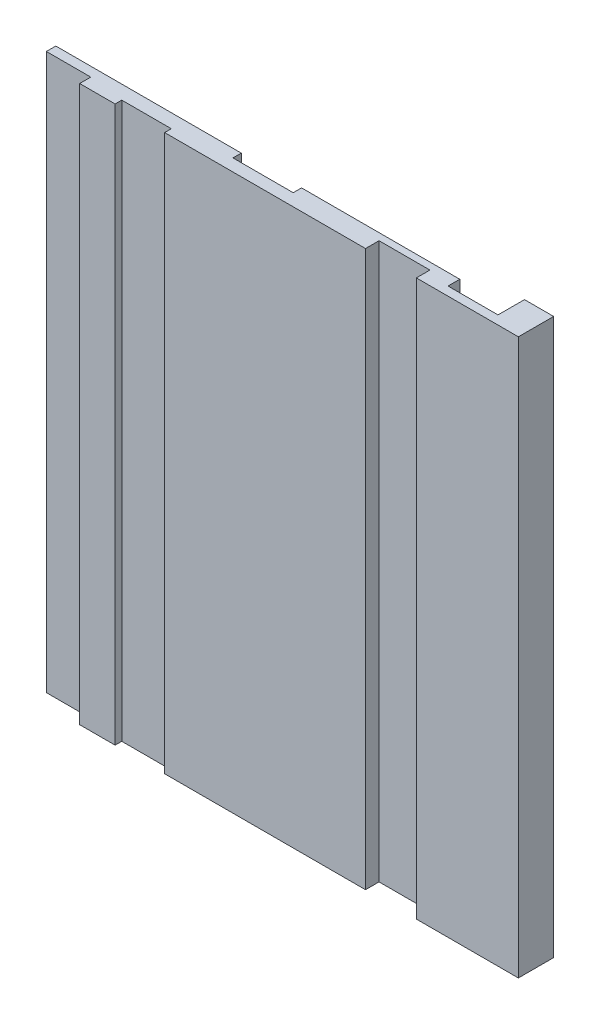
ISO-10303-21;
HEADER;
FILE_DESCRIPTION(('STEP AP214'),'2;1');
FILE_NAME('part.step','',(''),(''),'','','');
FILE_SCHEMA(('AUTOMOTIVE_DESIGN { 1 0 10303 214 1 1 1 1 }'));
ENDSEC;
DATA;
#1=APPLICATION_CONTEXT('core data for automotive mechanical design processes');
#2=APPLICATION_PROTOCOL_DEFINITION('international standard','automotive_design',2000,#1);
#3=PRODUCT_CONTEXT('',#1,'mechanical');
#4=PRODUCT('Part','Part','',(#3));
#5=PRODUCT_RELATED_PRODUCT_CATEGORY('part','',(#4));
#6=PRODUCT_DEFINITION_FORMATION('','',#4);
#7=PRODUCT_DEFINITION_CONTEXT('part definition',#1,'design');
#8=PRODUCT_DEFINITION('design','',#6,#7);
#9=PRODUCT_DEFINITION_SHAPE('','',#8);
#10=(LENGTH_UNIT() NAMED_UNIT(*) SI_UNIT(.MILLI.,.METRE.));
#11=(NAMED_UNIT(*) PLANE_ANGLE_UNIT() SI_UNIT($,.RADIAN.));
#12=(NAMED_UNIT(*) SI_UNIT($,.STERADIAN.) SOLID_ANGLE_UNIT());
#13=UNCERTAINTY_MEASURE_WITH_UNIT(LENGTH_MEASURE(1.E-05),#10,'distance_accuracy_value','');
#14=(GEOMETRIC_REPRESENTATION_CONTEXT(3) GLOBAL_UNCERTAINTY_ASSIGNED_CONTEXT((#13)) GLOBAL_UNIT_ASSIGNED_CONTEXT((#10,
#11,#12)) REPRESENTATION_CONTEXT('',''));
#15=CARTESIAN_POINT('',(0.,0.,0.));
#16=DIRECTION('',(0.,0.,1.));
#17=DIRECTION('',(1.,0.,0.));
#18=AXIS2_PLACEMENT_3D('',#15,#16,#17);
#19=CARTESIAN_POINT('',(0.,100.,0.));
#20=DIRECTION('',(-1.,0.,0.));
#21=DIRECTION('',(0.,0.,1.));
#22=AXIS2_PLACEMENT_3D('',#19,#20,#21);
#23=PLANE('',#22);
#24=DIRECTION('',(0.,0.,-1.));
#25=VECTOR('',#24,1.);
#26=CARTESIAN_POINT('',(0.,0.,0.));
#27=LINE('',#26,#25);
#28=CARTESIAN_POINT('',(0.,0.,0.));
#29=VERTEX_POINT('',#28);
#30=CARTESIAN_POINT('',(0.,0.,-6.35));
#31=VERTEX_POINT('',#30);
#32=EDGE_CURVE('E217',#29,#31,#27,.T.);
#33=ORIENTED_EDGE('',*,*,#32,.T.);
#34=DIRECTION('',(0.,-1.,0.));
#35=VECTOR('',#34,1.);
#36=CARTESIAN_POINT('',(0.,100.,-6.35));
#37=LINE('',#36,#35);
#38=CARTESIAN_POINT('',(0.,100.,-6.35));
#39=VERTEX_POINT('',#38);
#40=EDGE_CURVE('E11',#39,#31,#37,.T.);
#41=ORIENTED_EDGE('',*,*,#40,.F.);
#42=DIRECTION('',(0.,0.,-1.));
#43=VECTOR('',#42,1.);
#44=CARTESIAN_POINT('',(0.,100.,0.));
#45=LINE('',#44,#43);
#46=CARTESIAN_POINT('',(0.,100.,0.));
#47=VERTEX_POINT('',#46);
#48=EDGE_CURVE('E260',#47,#39,#45,.T.);
#49=ORIENTED_EDGE('',*,*,#48,.F.);
#50=DIRECTION('',(0.,-1.,0.));
#51=VECTOR('',#50,1.);
#52=CARTESIAN_POINT('',(0.,100.,0.));
#53=LINE('',#52,#51);
#54=EDGE_CURVE('E213',#47,#29,#53,.T.);
#55=ORIENTED_EDGE('',*,*,#54,.T.);
#56=EDGE_LOOP('',(#33,#41,#49,#55));
#57=FACE_BOUND('',#56,.T.);
#58=ADVANCED_FACE('F37',(#57),#23,.F.);
#59=CARTESIAN_POINT('',(0.,100.,-6.35));
#60=DIRECTION('',(0.,0.,1.));
#61=DIRECTION('',(1.,0.,0.));
#62=AXIS2_PLACEMENT_3D('',#59,#60,#61);
#63=PLANE('',#62);
#64=DIRECTION('',(-1.,0.,0.));
#65=VECTOR('',#64,1.);
#66=CARTESIAN_POINT('',(0.,0.,-6.35));
#67=LINE('',#66,#65);
#68=CARTESIAN_POINT('',(-5.25,0.,-6.35));
#69=VERTEX_POINT('',#68);
#70=EDGE_CURVE('E220',#31,#69,#67,.T.);
#71=ORIENTED_EDGE('',*,*,#70,.T.);
#72=DIRECTION('',(0.,-1.,0.));
#73=VECTOR('',#72,1.);
#74=CARTESIAN_POINT('',(-5.25,100.,-6.35));
#75=LINE('',#74,#73);
#76=CARTESIAN_POINT('',(-5.25,100.,-6.35));
#77=VERTEX_POINT('',#76);
#78=EDGE_CURVE('E45',#77,#69,#75,.T.);
#79=ORIENTED_EDGE('',*,*,#78,.F.);
#80=DIRECTION('',(-1.,0.,0.));
#81=VECTOR('',#80,1.);
#82=CARTESIAN_POINT('',(0.,100.,-6.35));
#83=LINE('',#82,#81);
#84=EDGE_CURVE('E138',#39,#77,#83,.T.);
#85=ORIENTED_EDGE('',*,*,#84,.F.);
#86=ORIENTED_EDGE('',*,*,#40,.T.);
#87=EDGE_LOOP('',(#71,#79,#85,#86));
#88=FACE_BOUND('',#87,.T.);
#89=ADVANCED_FACE('F317',(#88),#63,.F.);
#90=CARTESIAN_POINT('',(-5.25,100.,-1.58));
#91=DIRECTION('',(1.,0.,0.));
#92=DIRECTION('',(0.,0.,-1.));
#93=AXIS2_PLACEMENT_3D('',#90,#91,#92);
#94=PLANE('',#93);
#95=DIRECTION('',(0.,0.,1.));
#96=VECTOR('',#95,1.);
#97=CARTESIAN_POINT('',(-5.25,0.,-1.58));
#98=LINE('',#97,#96);
#99=CARTESIAN_POINT('',(-5.25,0.,-1.58));
#100=VERTEX_POINT('',#99);
#101=EDGE_CURVE('E223',#69,#100,#98,.T.);
#102=ORIENTED_EDGE('',*,*,#101,.T.);
#103=DIRECTION('',(0.,-1.,0.));
#104=VECTOR('',#103,1.);
#105=CARTESIAN_POINT('',(-5.25,100.,-1.58));
#106=LINE('',#105,#104);
#107=CARTESIAN_POINT('',(-5.25,100.,-1.58));
#108=VERTEX_POINT('',#107);
#109=EDGE_CURVE('E309',#108,#100,#106,.T.);
#110=ORIENTED_EDGE('',*,*,#109,.F.);
#111=DIRECTION('',(0.,0.,1.));
#112=VECTOR('',#111,1.);
#113=CARTESIAN_POINT('',(-5.25,100.,-3.69999999999999));
#114=LINE('',#113,#112);
#115=EDGE_CURVE('E316',#77,#108,#114,.T.);
#116=ORIENTED_EDGE('',*,*,#115,.F.);
#117=ORIENTED_EDGE('',*,*,#78,.T.);
#118=EDGE_LOOP('',(#102,#110,#116,#117));
#119=FACE_BOUND('',#118,.T.);
#120=ADVANCED_FACE('F314',(#119),#94,.F.);
#121=CARTESIAN_POINT('',(-14.25,100.,-1.58));
#122=DIRECTION('',(0.,0.,1.));
#123=DIRECTION('',(1.,0.,0.));
#124=AXIS2_PLACEMENT_3D('',#121,#122,#123);
#125=PLANE('',#124);
#126=DIRECTION('',(-1.,0.,0.));
#127=VECTOR('',#126,1.);
#128=CARTESIAN_POINT('',(-14.25,0.,-1.58));
#129=LINE('',#128,#127);
#130=CARTESIAN_POINT('',(-14.25,0.,-1.58));
#131=VERTEX_POINT('',#130);
#132=EDGE_CURVE('E225',#100,#131,#129,.T.);
#133=ORIENTED_EDGE('',*,*,#132,.T.);
#134=DIRECTION('',(0.,-1.,0.));
#135=VECTOR('',#134,1.);
#136=CARTESIAN_POINT('',(-14.25,100.,-1.58));
#137=LINE('',#136,#135);
#138=CARTESIAN_POINT('',(-14.25,100.,-1.58));
#139=VERTEX_POINT('',#138);
#140=EDGE_CURVE('E306',#139,#131,#137,.T.);
#141=ORIENTED_EDGE('',*,*,#140,.F.);
#142=DIRECTION('',(-1.,0.,0.));
#143=VECTOR('',#142,1.);
#144=CARTESIAN_POINT('',(-14.25,100.,-1.58));
#145=LINE('',#144,#143);
#146=EDGE_CURVE('E336',#108,#139,#145,.T.);
#147=ORIENTED_EDGE('',*,*,#146,.F.);
#148=ORIENTED_EDGE('',*,*,#109,.T.);
#149=EDGE_LOOP('',(#133,#141,#147,#148));
#150=FACE_BOUND('',#149,.T.);
#151=ADVANCED_FACE('F327',(#150),#125,.F.);
#152=CARTESIAN_POINT('',(-14.25,100.,-3.69999999999998));
#153=DIRECTION('',(-1.,0.,0.));
#154=DIRECTION('',(0.,0.,1.));
#155=AXIS2_PLACEMENT_3D('',#152,#153,#154);
#156=PLANE('',#155);
#157=DIRECTION('',(0.,0.,-1.));
#158=VECTOR('',#157,1.);
#159=CARTESIAN_POINT('',(-14.25,0.,-3.69999999999998));
#160=LINE('',#159,#158);
#161=CARTESIAN_POINT('',(-14.25,0.,-3.69999999999998));
#162=VERTEX_POINT('',#161);
#163=EDGE_CURVE('E227',#131,#162,#160,.T.);
#164=ORIENTED_EDGE('',*,*,#163,.T.);
#165=DIRECTION('',(0.,-1.,0.));
#166=VECTOR('',#165,1.);
#167=CARTESIAN_POINT('',(-14.25,100.,-3.69999999999998));
#168=LINE('',#167,#166);
#169=CARTESIAN_POINT('',(-14.25,100.,-3.69999999999998));
#170=VERTEX_POINT('',#169);
#171=EDGE_CURVE('E303',#170,#162,#168,.T.);
#172=ORIENTED_EDGE('',*,*,#171,.F.);
#173=DIRECTION('',(0.,0.,-1.));
#174=VECTOR('',#173,1.);
#175=CARTESIAN_POINT('',(-14.25,100.,-3.69999999999998));
#176=LINE('',#175,#174);
#177=EDGE_CURVE('E333',#139,#170,#176,.T.);
#178=ORIENTED_EDGE('',*,*,#177,.F.);
#179=ORIENTED_EDGE('',*,*,#140,.T.);
#180=EDGE_LOOP('',(#164,#172,#178,#179));
#181=FACE_BOUND('',#180,.T.);
#182=ADVANCED_FACE('F331',(#181),#156,.F.);
#183=CARTESIAN_POINT('',(-42.75,100.,-3.69999999999998));
#184=DIRECTION('',(0.,0.,1.));
#185=DIRECTION('',(1.,0.,0.));
#186=AXIS2_PLACEMENT_3D('',#183,#184,#185);
#187=PLANE('',#186);
#188=DIRECTION('',(-1.,0.,0.));
#189=VECTOR('',#188,1.);
#190=CARTESIAN_POINT('',(-42.75,0.,-3.69999999999998));
#191=LINE('',#190,#189);
#192=CARTESIAN_POINT('',(-42.75,0.,-3.69999999999998));
#193=VERTEX_POINT('',#192);
#194=EDGE_CURVE('E229',#162,#193,#191,.T.);
#195=ORIENTED_EDGE('',*,*,#194,.T.);
#196=DIRECTION('',(0.,-1.,0.));
#197=VECTOR('',#196,1.);
#198=CARTESIAN_POINT('',(-42.75,100.,-3.69999999999998));
#199=LINE('',#198,#197);
#200=CARTESIAN_POINT('',(-42.75,100.,-3.69999999999998));
#201=VERTEX_POINT('',#200);
#202=EDGE_CURVE('E300',#201,#193,#199,.T.);
#203=ORIENTED_EDGE('',*,*,#202,.F.);
#204=DIRECTION('',(-1.,0.,0.));
#205=VECTOR('',#204,1.);
#206=CARTESIAN_POINT('',(-42.75,100.,-3.69999999999998));
#207=LINE('',#206,#205);
#208=EDGE_CURVE('E335',#170,#201,#207,.T.);
#209=ORIENTED_EDGE('',*,*,#208,.F.);
#210=ORIENTED_EDGE('',*,*,#171,.T.);
#211=EDGE_LOOP('',(#195,#203,#209,#210));
#212=FACE_BOUND('',#211,.T.);
#213=ADVANCED_FACE('F430',(#212),#187,.F.);
#214=CARTESIAN_POINT('',(-42.75,100.,-3.69999999999998));
#215=DIRECTION('',(1.,0.,0.));
#216=DIRECTION('',(0.,0.,-1.));
#217=AXIS2_PLACEMENT_3D('',#214,#215,#216);
#218=PLANE('',#217);
#219=DIRECTION('',(0.,0.,1.));
#220=VECTOR('',#219,1.);
#221=CARTESIAN_POINT('',(-42.75,0.,-3.69999999999998));
#222=LINE('',#221,#220);
#223=CARTESIAN_POINT('',(-42.75,0.,-2.19999999999998));
#224=VERTEX_POINT('',#223);
#225=EDGE_CURVE('E231',#193,#224,#222,.T.);
#226=ORIENTED_EDGE('',*,*,#225,.T.);
#227=DIRECTION('',(0.,-1.,0.));
#228=VECTOR('',#227,1.);
#229=CARTESIAN_POINT('',(-42.75,100.,-2.19999999999998));
#230=LINE('',#229,#228);
#231=CARTESIAN_POINT('',(-42.75,100.,-2.19999999999998));
#232=VERTEX_POINT('',#231);
#233=EDGE_CURVE('E297',#232,#224,#230,.T.);
#234=ORIENTED_EDGE('',*,*,#233,.F.);
#235=DIRECTION('',(0.,0.,1.));
#236=VECTOR('',#235,1.);
#237=CARTESIAN_POINT('',(-42.75,100.,-3.69999999999998));
#238=LINE('',#237,#236);
#239=EDGE_CURVE('E338',#201,#232,#238,.T.);
#240=ORIENTED_EDGE('',*,*,#239,.F.);
#241=ORIENTED_EDGE('',*,*,#202,.T.);
#242=EDGE_LOOP('',(#226,#234,#240,#241));
#243=FACE_BOUND('',#242,.T.);
#244=ADVANCED_FACE('F427',(#243),#218,.F.);
#245=CARTESIAN_POINT('',(-42.75,100.,-2.19999999999998));
#246=DIRECTION('',(0.,0.,1.));
#247=DIRECTION('',(1.,0.,0.));
#248=AXIS2_PLACEMENT_3D('',#245,#246,#247);
#249=PLANE('',#248);
#250=DIRECTION('',(-1.,0.,0.));
#251=VECTOR('',#250,1.);
#252=CARTESIAN_POINT('',(-42.75,0.,-2.19999999999998));
#253=LINE('',#252,#251);
#254=CARTESIAN_POINT('',(-53.6,0.,-2.19999999999998));
#255=VERTEX_POINT('',#254);
#256=EDGE_CURVE('E233',#224,#255,#253,.T.);
#257=ORIENTED_EDGE('',*,*,#256,.T.);
#258=DIRECTION('',(0.,-1.,0.));
#259=VECTOR('',#258,1.);
#260=CARTESIAN_POINT('',(-53.6,100.,-2.19999999999998));
#261=LINE('',#260,#259);
#262=CARTESIAN_POINT('',(-53.6,100.,-2.19999999999998));
#263=VERTEX_POINT('',#262);
#264=EDGE_CURVE('E294',#263,#255,#261,.T.);
#265=ORIENTED_EDGE('',*,*,#264,.F.);
#266=DIRECTION('',(-1.,0.,0.));
#267=VECTOR('',#266,1.);
#268=CARTESIAN_POINT('',(-42.75,100.,-2.19999999999998));
#269=LINE('',#268,#267);
#270=EDGE_CURVE('E344',#232,#263,#269,.T.);
#271=ORIENTED_EDGE('',*,*,#270,.F.);
#272=ORIENTED_EDGE('',*,*,#233,.T.);
#273=EDGE_LOOP('',(#257,#265,#271,#272));
#274=FACE_BOUND('',#273,.T.);
#275=ADVANCED_FACE('F422',(#274),#249,.F.);
#276=CARTESIAN_POINT('',(-53.6,100.,-2.19999999999998));
#277=DIRECTION('',(-1.,0.,0.));
#278=DIRECTION('',(0.,0.,1.));
#279=AXIS2_PLACEMENT_3D('',#276,#277,#278);
#280=PLANE('',#279);
#281=DIRECTION('',(0.,0.,-1.));
#282=VECTOR('',#281,1.);
#283=CARTESIAN_POINT('',(-53.6,0.,-2.19999999999998));
#284=LINE('',#283,#282);
#285=CARTESIAN_POINT('',(-53.6,0.,-3.69999999999998));
#286=VERTEX_POINT('',#285);
#287=EDGE_CURVE('E235',#255,#286,#284,.T.);
#288=ORIENTED_EDGE('',*,*,#287,.T.);
#289=DIRECTION('',(0.,-1.,0.));
#290=VECTOR('',#289,1.);
#291=CARTESIAN_POINT('',(-53.6,100.,-3.69999999999998));
#292=LINE('',#291,#290);
#293=CARTESIAN_POINT('',(-53.6,100.,-3.69999999999998));
#294=VERTEX_POINT('',#293);
#295=EDGE_CURVE('E291',#294,#286,#292,.T.);
#296=ORIENTED_EDGE('',*,*,#295,.F.);
#297=DIRECTION('',(0.,0.,-1.));
#298=VECTOR('',#297,1.);
#299=CARTESIAN_POINT('',(-53.6,100.,-2.19999999999998));
#300=LINE('',#299,#298);
#301=EDGE_CURVE('E346',#263,#294,#300,.T.);
#302=ORIENTED_EDGE('',*,*,#301,.F.);
#303=ORIENTED_EDGE('',*,*,#264,.T.);
#304=EDGE_LOOP('',(#288,#296,#302,#303));
#305=FACE_BOUND('',#304,.T.);
#306=ADVANCED_FACE('F417',(#305),#280,.F.);
#307=CARTESIAN_POINT('',(-87.,100.,-3.69999999999999));
#308=DIRECTION('',(0.,0.,1.));
#309=DIRECTION('',(1.,0.,0.));
#310=AXIS2_PLACEMENT_3D('',#307,#308,#309);
#311=PLANE('',#310);
#312=DIRECTION('',(-1.,0.,0.));
#313=VECTOR('',#312,1.);
#314=CARTESIAN_POINT('',(-87.,0.,-3.69999999999999));
#315=LINE('',#314,#313);
#316=CARTESIAN_POINT('',(-87.,0.,-3.69999999999999));
#317=VERTEX_POINT('',#316);
#318=EDGE_CURVE('E237',#286,#317,#315,.T.);
#319=ORIENTED_EDGE('',*,*,#318,.T.);
#320=DIRECTION('',(0.,-1.,0.));
#321=VECTOR('',#320,1.);
#322=CARTESIAN_POINT('',(-87.,100.,-3.69999999999999));
#323=LINE('',#322,#321);
#324=CARTESIAN_POINT('',(-87.,100.,-3.69999999999999));
#325=VERTEX_POINT('',#324);
#326=EDGE_CURVE('E288',#325,#317,#323,.T.);
#327=ORIENTED_EDGE('',*,*,#326,.F.);
#328=DIRECTION('',(-1.,0.,0.));
#329=VECTOR('',#328,1.);
#330=CARTESIAN_POINT('',(-87.,100.,-3.69999999999999));
#331=LINE('',#330,#329);
#332=EDGE_CURVE('E348',#294,#325,#331,.T.);
#333=ORIENTED_EDGE('',*,*,#332,.F.);
#334=ORIENTED_EDGE('',*,*,#295,.T.);
#335=EDGE_LOOP('',(#319,#327,#333,#334));
#336=FACE_BOUND('',#335,.T.);
#337=ADVANCED_FACE('F413',(#336),#311,.F.);
#338=CARTESIAN_POINT('',(-87.,100.,-1.99999999999999));
#339=DIRECTION('',(1.,0.,0.));
#340=DIRECTION('',(0.,0.,-1.));
#341=AXIS2_PLACEMENT_3D('',#338,#339,#340);
#342=PLANE('',#341);
#343=DIRECTION('',(0.,0.,1.));
#344=VECTOR('',#343,1.);
#345=CARTESIAN_POINT('',(-87.,0.,-1.99999999999999));
#346=LINE('',#345,#344);
#347=CARTESIAN_POINT('',(-87.,0.,-1.99999999999999));
#348=VERTEX_POINT('',#347);
#349=EDGE_CURVE('E239',#317,#348,#346,.T.);
#350=ORIENTED_EDGE('',*,*,#349,.T.);
#351=DIRECTION('',(0.,-1.,0.));
#352=VECTOR('',#351,1.);
#353=CARTESIAN_POINT('',(-87.,100.,-1.99999999999999));
#354=LINE('',#353,#352);
#355=CARTESIAN_POINT('',(-87.,100.,-1.99999999999999));
#356=VERTEX_POINT('',#355);
#357=EDGE_CURVE('E285',#356,#348,#354,.T.);
#358=ORIENTED_EDGE('',*,*,#357,.F.);
#359=DIRECTION('',(0.,0.,1.));
#360=VECTOR('',#359,1.);
#361=CARTESIAN_POINT('',(-87.,100.,-1.99999999999999));
#362=LINE('',#361,#360);
#363=EDGE_CURVE('E350',#325,#356,#362,.T.);
#364=ORIENTED_EDGE('',*,*,#363,.F.);
#365=ORIENTED_EDGE('',*,*,#326,.T.);
#366=EDGE_LOOP('',(#350,#358,#364,#365));
#367=FACE_BOUND('',#366,.T.);
#368=ADVANCED_FACE('F408',(#367),#342,.F.);
#369=CARTESIAN_POINT('',(-87.,100.,-1.99999999999999));
#370=DIRECTION('',(0.,0.,-1.));
#371=DIRECTION('',(-1.,0.,0.));
#372=AXIS2_PLACEMENT_3D('',#369,#370,#371);
#373=PLANE('',#372);
#374=DIRECTION('',(1.,0.,0.));
#375=VECTOR('',#374,1.);
#376=CARTESIAN_POINT('',(-87.,0.,-1.99999999999999));
#377=LINE('',#376,#375);
#378=CARTESIAN_POINT('',(-79.,0.,-1.99999999999999));
#379=VERTEX_POINT('',#378);
#380=EDGE_CURVE('E241',#348,#379,#377,.T.);
#381=ORIENTED_EDGE('',*,*,#380,.T.);
#382=DIRECTION('',(0.,-1.,0.));
#383=VECTOR('',#382,1.);
#384=CARTESIAN_POINT('',(-79.,100.,-1.99999999999999));
#385=LINE('',#384,#383);
#386=CARTESIAN_POINT('',(-79.,100.,-1.99999999999999));
#387=VERTEX_POINT('',#386);
#388=EDGE_CURVE('E282',#387,#379,#385,.T.);
#389=ORIENTED_EDGE('',*,*,#388,.F.);
#390=DIRECTION('',(1.,0.,0.));
#391=VECTOR('',#390,1.);
#392=CARTESIAN_POINT('',(-87.,100.,-1.99999999999999));
#393=LINE('',#392,#391);
#394=EDGE_CURVE('E352',#356,#387,#393,.T.);
#395=ORIENTED_EDGE('',*,*,#394,.F.);
#396=ORIENTED_EDGE('',*,*,#357,.T.);
#397=EDGE_LOOP('',(#381,#389,#395,#396));
#398=FACE_BOUND('',#397,.T.);
#399=ADVANCED_FACE('F402',(#398),#373,.F.);
#400=CARTESIAN_POINT('',(-79.,100.,-1.99999999999999));
#401=DIRECTION('',(1.,0.,0.));
#402=DIRECTION('',(0.,0.,-1.));
#403=AXIS2_PLACEMENT_3D('',#400,#401,#402);
#404=PLANE('',#403);
#405=DIRECTION('',(0.,0.,1.));
#406=VECTOR('',#405,1.);
#407=CARTESIAN_POINT('',(-79.,0.,-1.99999999999999));
#408=LINE('',#407,#406);
#409=CARTESIAN_POINT('',(-79.,0.,0.));
#410=VERTEX_POINT('',#409);
#411=EDGE_CURVE('E243',#379,#410,#408,.T.);
#412=ORIENTED_EDGE('',*,*,#411,.T.);
#413=DIRECTION('',(0.,-1.,0.));
#414=VECTOR('',#413,1.);
#415=CARTESIAN_POINT('',(-79.,100.,0.));
#416=LINE('',#415,#414);
#417=CARTESIAN_POINT('',(-79.,100.,0.));
#418=VERTEX_POINT('',#417);
#419=EDGE_CURVE('E279',#418,#410,#416,.T.);
#420=ORIENTED_EDGE('',*,*,#419,.F.);
#421=DIRECTION('',(0.,0.,1.));
#422=VECTOR('',#421,1.);
#423=CARTESIAN_POINT('',(-79.,100.,-1.99999999999999));
#424=LINE('',#423,#422);
#425=EDGE_CURVE('E354',#387,#418,#424,.T.);
#426=ORIENTED_EDGE('',*,*,#425,.F.);
#427=ORIENTED_EDGE('',*,*,#388,.T.);
#428=EDGE_LOOP('',(#412,#420,#426,#427));
#429=FACE_BOUND('',#428,.T.);
#430=ADVANCED_FACE('F398',(#429),#404,.F.);
#431=CARTESIAN_POINT('',(-72.62,100.,0.));
#432=DIRECTION('',(0.,0.,-1.));
#433=DIRECTION('',(-1.,0.,0.));
#434=AXIS2_PLACEMENT_3D('',#431,#432,#433);
#435=PLANE('',#434);
#436=DIRECTION('',(1.,0.,0.));
#437=VECTOR('',#436,1.);
#438=CARTESIAN_POINT('',(-72.62,0.,0.));
#439=LINE('',#438,#437);
#440=CARTESIAN_POINT('',(-72.62,0.,0.));
#441=VERTEX_POINT('',#440);
#442=EDGE_CURVE('E245',#410,#441,#439,.T.);
#443=ORIENTED_EDGE('',*,*,#442,.T.);
#444=DIRECTION('',(0.,-1.,0.));
#445=VECTOR('',#444,1.);
#446=CARTESIAN_POINT('',(-72.62,100.,0.));
#447=LINE('',#446,#445);
#448=CARTESIAN_POINT('',(-72.62,100.,0.));
#449=VERTEX_POINT('',#448);
#450=EDGE_CURVE('E276',#449,#441,#447,.T.);
#451=ORIENTED_EDGE('',*,*,#450,.F.);
#452=DIRECTION('',(1.,0.,0.));
#453=VECTOR('',#452,1.);
#454=CARTESIAN_POINT('',(-72.62,100.,0.));
#455=LINE('',#454,#453);
#456=EDGE_CURVE('E356',#418,#449,#455,.T.);
#457=ORIENTED_EDGE('',*,*,#456,.F.);
#458=ORIENTED_EDGE('',*,*,#419,.T.);
#459=EDGE_LOOP('',(#443,#451,#457,#458));
#460=FACE_BOUND('',#459,.T.);
#461=ADVANCED_FACE('F393',(#460),#435,.F.);
#462=CARTESIAN_POINT('',(-72.62,100.,0.));
#463=DIRECTION('',(-1.,0.,0.));
#464=DIRECTION('',(0.,0.,1.));
#465=AXIS2_PLACEMENT_3D('',#462,#463,#464);
#466=PLANE('',#465);
#467=DIRECTION('',(0.,0.,-1.));
#468=VECTOR('',#467,1.);
#469=CARTESIAN_POINT('',(-72.62,0.,0.));
#470=LINE('',#469,#468);
#471=CARTESIAN_POINT('',(-72.62,0.,-1.19999999999999));
#472=VERTEX_POINT('',#471);
#473=EDGE_CURVE('E247',#441,#472,#470,.T.);
#474=ORIENTED_EDGE('',*,*,#473,.T.);
#475=DIRECTION('',(0.,-1.,0.));
#476=VECTOR('',#475,1.);
#477=CARTESIAN_POINT('',(-72.62,100.,-1.19999999999999));
#478=LINE('',#477,#476);
#479=CARTESIAN_POINT('',(-72.62,100.,-1.19999999999999));
#480=VERTEX_POINT('',#479);
#481=EDGE_CURVE('E273',#480,#472,#478,.T.);
#482=ORIENTED_EDGE('',*,*,#481,.F.);
#483=DIRECTION('',(0.,0.,-1.));
#484=VECTOR('',#483,1.);
#485=CARTESIAN_POINT('',(-72.62,100.,0.));
#486=LINE('',#485,#484);
#487=EDGE_CURVE('E358',#449,#480,#486,.T.);
#488=ORIENTED_EDGE('',*,*,#487,.F.);
#489=ORIENTED_EDGE('',*,*,#450,.T.);
#490=EDGE_LOOP('',(#474,#482,#488,#489));
#491=FACE_BOUND('',#490,.T.);
#492=ADVANCED_FACE('F387',(#491),#466,.F.);
#493=CARTESIAN_POINT('',(-72.62,100.,-1.19999999999999));
#494=DIRECTION('',(0.,0.,-1.));
#495=DIRECTION('',(-1.,0.,0.));
#496=AXIS2_PLACEMENT_3D('',#493,#494,#495);
#497=PLANE('',#496);
#498=DIRECTION('',(1.,0.,0.));
#499=VECTOR('',#498,1.);
#500=CARTESIAN_POINT('',(-72.62,0.,-1.19999999999999));
#501=LINE('',#500,#499);
#502=CARTESIAN_POINT('',(-63.7,0.,-1.19999999999999));
#503=VERTEX_POINT('',#502);
#504=EDGE_CURVE('E249',#472,#503,#501,.T.);
#505=ORIENTED_EDGE('',*,*,#504,.T.);
#506=DIRECTION('',(0.,-1.,0.));
#507=VECTOR('',#506,1.);
#508=CARTESIAN_POINT('',(-63.7,100.,-1.19999999999999));
#509=LINE('',#508,#507);
#510=CARTESIAN_POINT('',(-63.7,100.,-1.19999999999999));
#511=VERTEX_POINT('',#510);
#512=EDGE_CURVE('E270',#511,#503,#509,.T.);
#513=ORIENTED_EDGE('',*,*,#512,.F.);
#514=DIRECTION('',(1.,0.,0.));
#515=VECTOR('',#514,1.);
#516=CARTESIAN_POINT('',(-72.62,100.,-1.19999999999999));
#517=LINE('',#516,#515);
#518=EDGE_CURVE('E360',#480,#511,#517,.T.);
#519=ORIENTED_EDGE('',*,*,#518,.F.);
#520=ORIENTED_EDGE('',*,*,#481,.T.);
#521=EDGE_LOOP('',(#505,#513,#519,#520));
#522=FACE_BOUND('',#521,.T.);
#523=ADVANCED_FACE('F383',(#522),#497,.F.);
#524=CARTESIAN_POINT('',(-63.7,100.,-1.19999999999999));
#525=DIRECTION('',(1.,0.,0.));
#526=DIRECTION('',(0.,0.,-1.));
#527=AXIS2_PLACEMENT_3D('',#524,#525,#526);
#528=PLANE('',#527);
#529=DIRECTION('',(0.,0.,1.));
#530=VECTOR('',#529,1.);
#531=CARTESIAN_POINT('',(-63.7,0.,-1.19999999999999));
#532=LINE('',#531,#530);
#533=CARTESIAN_POINT('',(-63.7,0.,0.));
#534=VERTEX_POINT('',#533);
#535=EDGE_CURVE('E251',#503,#534,#532,.T.);
#536=ORIENTED_EDGE('',*,*,#535,.T.);
#537=DIRECTION('',(0.,-1.,0.));
#538=VECTOR('',#537,1.);
#539=CARTESIAN_POINT('',(-63.7,100.,0.));
#540=LINE('',#539,#538);
#541=CARTESIAN_POINT('',(-63.7,100.,0.));
#542=VERTEX_POINT('',#541);
#543=EDGE_CURVE('E267',#542,#534,#540,.T.);
#544=ORIENTED_EDGE('',*,*,#543,.F.);
#545=DIRECTION('',(0.,0.,1.));
#546=VECTOR('',#545,1.);
#547=CARTESIAN_POINT('',(-63.7,100.,-1.19999999999999));
#548=LINE('',#547,#546);
#549=EDGE_CURVE('E362',#511,#542,#548,.T.);
#550=ORIENTED_EDGE('',*,*,#549,.F.);
#551=ORIENTED_EDGE('',*,*,#512,.T.);
#552=EDGE_LOOP('',(#536,#544,#550,#551));
#553=FACE_BOUND('',#552,.T.);
#554=ADVANCED_FACE('F379',(#553),#528,.F.);
#555=CARTESIAN_POINT('',(-27.53,100.,0.));
#556=DIRECTION('',(0.,0.,-1.));
#557=DIRECTION('',(-1.,0.,0.));
#558=AXIS2_PLACEMENT_3D('',#555,#556,#557);
#559=PLANE('',#558);
#560=DIRECTION('',(1.,0.,0.));
#561=VECTOR('',#560,1.);
#562=CARTESIAN_POINT('',(-27.53,0.,0.));
#563=LINE('',#562,#561);
#564=CARTESIAN_POINT('',(-27.53,0.,0.));
#565=VERTEX_POINT('',#564);
#566=EDGE_CURVE('E253',#534,#565,#563,.T.);
#567=ORIENTED_EDGE('',*,*,#566,.T.);
#568=DIRECTION('',(0.,-1.,0.));
#569=VECTOR('',#568,1.);
#570=CARTESIAN_POINT('',(-27.53,100.,0.));
#571=LINE('',#570,#569);
#572=CARTESIAN_POINT('',(-27.53,100.,0.));
#573=VERTEX_POINT('',#572);
#574=EDGE_CURVE('E264',#573,#565,#571,.T.);
#575=ORIENTED_EDGE('',*,*,#574,.F.);
#576=DIRECTION('',(1.,0.,0.));
#577=VECTOR('',#576,1.);
#578=CARTESIAN_POINT('',(-27.53,100.,0.));
#579=LINE('',#578,#577);
#580=EDGE_CURVE('E364',#542,#573,#579,.T.);
#581=ORIENTED_EDGE('',*,*,#580,.F.);
#582=ORIENTED_EDGE('',*,*,#543,.T.);
#583=EDGE_LOOP('',(#567,#575,#581,#582));
#584=FACE_BOUND('',#583,.T.);
#585=ADVANCED_FACE('F370',(#584),#559,.F.);
#586=CARTESIAN_POINT('',(-27.53,100.,-2.44));
#587=DIRECTION('',(-1.,0.,0.));
#588=DIRECTION('',(0.,0.,1.));
#589=AXIS2_PLACEMENT_3D('',#586,#587,#588);
#590=PLANE('',#589);
#591=DIRECTION('',(0.,0.,-1.));
#592=VECTOR('',#591,1.);
#593=CARTESIAN_POINT('',(-27.53,0.,-2.44));
#594=LINE('',#593,#592);
#595=CARTESIAN_POINT('',(-27.53,0.,-2.44));
#596=VERTEX_POINT('',#595);
#597=EDGE_CURVE('E255',#565,#596,#594,.T.);
#598=ORIENTED_EDGE('',*,*,#597,.T.);
#599=DIRECTION('',(0.,-1.,0.));
#600=VECTOR('',#599,1.);
#601=CARTESIAN_POINT('',(-27.53,100.,-2.44));
#602=LINE('',#601,#600);
#603=CARTESIAN_POINT('',(-27.53,100.,-2.44));
#604=VERTEX_POINT('',#603);
#605=EDGE_CURVE('E208',#604,#596,#602,.T.);
#606=ORIENTED_EDGE('',*,*,#605,.F.);
#607=DIRECTION('',(0.,0.,-1.));
#608=VECTOR('',#607,1.);
#609=CARTESIAN_POINT('',(-27.53,100.,-2.44));
#610=LINE('',#609,#608);
#611=EDGE_CURVE('E199',#573,#604,#610,.T.);
#612=ORIENTED_EDGE('',*,*,#611,.F.);
#613=ORIENTED_EDGE('',*,*,#574,.T.);
#614=EDGE_LOOP('',(#598,#606,#612,#613));
#615=FACE_BOUND('',#614,.T.);
#616=ADVANCED_FACE('F374',(#615),#590,.F.);
#617=CARTESIAN_POINT('',(-18.37,100.,-2.44));
#618=DIRECTION('',(0.,0.,-1.));
#619=DIRECTION('',(-1.,0.,0.));
#620=AXIS2_PLACEMENT_3D('',#617,#618,#619);
#621=PLANE('',#620);
#622=DIRECTION('',(1.,0.,0.));
#623=VECTOR('',#622,1.);
#624=CARTESIAN_POINT('',(-18.37,0.,-2.44));
#625=LINE('',#624,#623);
#626=CARTESIAN_POINT('',(-18.37,0.,-2.44));
#627=VERTEX_POINT('',#626);
#628=EDGE_CURVE('E207',#596,#627,#625,.T.);
#629=ORIENTED_EDGE('',*,*,#628,.T.);
#630=DIRECTION('',(0.,-1.,0.));
#631=VECTOR('',#630,1.);
#632=CARTESIAN_POINT('',(-18.37,100.,-2.44));
#633=LINE('',#632,#631);
#634=CARTESIAN_POINT('',(-18.37,100.,-2.44));
#635=VERTEX_POINT('',#634);
#636=EDGE_CURVE('E204',#635,#627,#633,.T.);
#637=ORIENTED_EDGE('',*,*,#636,.F.);
#638=DIRECTION('',(1.,0.,0.));
#639=VECTOR('',#638,1.);
#640=CARTESIAN_POINT('',(-18.37,100.,-2.44));
#641=LINE('',#640,#639);
#642=EDGE_CURVE('E193',#604,#635,#641,.T.);
#643=ORIENTED_EDGE('',*,*,#642,.F.);
#644=ORIENTED_EDGE('',*,*,#605,.T.);
#645=EDGE_LOOP('',(#629,#637,#643,#644));
#646=FACE_BOUND('',#645,.T.);
#647=ADVANCED_FACE('F205',(#646),#621,.F.);
#648=CARTESIAN_POINT('',(-18.37,100.,0.));
#649=DIRECTION('',(1.,0.,0.));
#650=DIRECTION('',(0.,0.,-1.));
#651=AXIS2_PLACEMENT_3D('',#648,#649,#650);
#652=PLANE('',#651);
#653=DIRECTION('',(0.,0.,1.));
#654=VECTOR('',#653,1.);
#655=CARTESIAN_POINT('',(-18.37,0.,0.));
#656=LINE('',#655,#654);
#657=CARTESIAN_POINT('',(-18.37,0.,0.));
#658=VERTEX_POINT('',#657);
#659=EDGE_CURVE('E124',#627,#658,#656,.T.);
#660=ORIENTED_EDGE('',*,*,#659,.T.);
#661=DIRECTION('',(0.,-1.,0.));
#662=VECTOR('',#661,1.);
#663=CARTESIAN_POINT('',(-18.37,100.,0.));
#664=LINE('',#663,#662);
#665=CARTESIAN_POINT('',(-18.37,100.,0.));
#666=VERTEX_POINT('',#665);
#667=EDGE_CURVE('E209',#666,#658,#664,.T.);
#668=ORIENTED_EDGE('',*,*,#667,.F.);
#669=DIRECTION('',(0.,0.,1.));
#670=VECTOR('',#669,1.);
#671=CARTESIAN_POINT('',(-18.37,100.,0.));
#672=LINE('',#671,#670);
#673=EDGE_CURVE('E197',#635,#666,#672,.T.);
#674=ORIENTED_EDGE('',*,*,#673,.F.);
#675=ORIENTED_EDGE('',*,*,#636,.T.);
#676=EDGE_LOOP('',(#660,#668,#674,#675));
#677=FACE_BOUND('',#676,.T.);
#678=ADVANCED_FACE('F211',(#677),#652,.F.);
#679=CARTESIAN_POINT('',(0.,100.,0.));
#680=DIRECTION('',(0.,0.,-1.));
#681=DIRECTION('',(-1.,0.,0.));
#682=AXIS2_PLACEMENT_3D('',#679,#680,#681);
#683=PLANE('',#682);
#684=DIRECTION('',(1.,0.,0.));
#685=VECTOR('',#684,1.);
#686=CARTESIAN_POINT('',(0.,0.,0.));
#687=LINE('',#686,#685);
#688=EDGE_CURVE('E130',#658,#29,#687,.T.);
#689=ORIENTED_EDGE('',*,*,#688,.T.);
#690=ORIENTED_EDGE('',*,*,#54,.F.);
#691=DIRECTION('',(1.,0.,0.));
#692=VECTOR('',#691,1.);
#693=CARTESIAN_POINT('',(0.,100.,0.));
#694=LINE('',#693,#692);
#695=EDGE_CURVE('E53',#666,#47,#694,.T.);
#696=ORIENTED_EDGE('',*,*,#695,.F.);
#697=ORIENTED_EDGE('',*,*,#667,.T.);
#698=EDGE_LOOP('',(#689,#690,#696,#697));
#699=FACE_BOUND('',#698,.T.);
#700=ADVANCED_FACE('F445',(#699),#683,.F.);
#701=CARTESIAN_POINT('',(0.,100.,0.));
#702=DIRECTION('',(0.,1.,0.));
#703=DIRECTION('',(0.,0.,1.));
#704=AXIS2_PLACEMENT_3D('',#701,#702,#703);
#705=PLANE('',#704);
#706=ORIENTED_EDGE('',*,*,#48,.T.);
#707=ORIENTED_EDGE('',*,*,#84,.T.);
#708=ORIENTED_EDGE('',*,*,#115,.T.);
#709=ORIENTED_EDGE('',*,*,#146,.T.);
#710=ORIENTED_EDGE('',*,*,#177,.T.);
#711=ORIENTED_EDGE('',*,*,#208,.T.);
#712=ORIENTED_EDGE('',*,*,#239,.T.);
#713=ORIENTED_EDGE('',*,*,#270,.T.);
#714=ORIENTED_EDGE('',*,*,#301,.T.);
#715=ORIENTED_EDGE('',*,*,#332,.T.);
#716=ORIENTED_EDGE('',*,*,#363,.T.);
#717=ORIENTED_EDGE('',*,*,#394,.T.);
#718=ORIENTED_EDGE('',*,*,#425,.T.);
#719=ORIENTED_EDGE('',*,*,#456,.T.);
#720=ORIENTED_EDGE('',*,*,#487,.T.);
#721=ORIENTED_EDGE('',*,*,#518,.T.);
#722=ORIENTED_EDGE('',*,*,#549,.T.);
#723=ORIENTED_EDGE('',*,*,#580,.T.);
#724=ORIENTED_EDGE('',*,*,#611,.T.);
#725=ORIENTED_EDGE('',*,*,#642,.T.);
#726=ORIENTED_EDGE('',*,*,#673,.T.);
#727=ORIENTED_EDGE('',*,*,#695,.T.);
#728=EDGE_LOOP('',(#706,#707,#708,#709,#710,#711,#712,#713,#714,#715,#716,#717,#718,#719,#720,
#721,#722,#723,#724,#725,#726,#727));
#729=FACE_BOUND('',#728,.T.);
#730=ADVANCED_FACE('F195',(#729),#705,.T.);
#731=CARTESIAN_POINT('',(0.,0.,0.));
#732=DIRECTION('',(0.,1.,0.));
#733=DIRECTION('',(0.,0.,1.));
#734=AXIS2_PLACEMENT_3D('',#731,#732,#733);
#735=PLANE('',#734);
#736=ORIENTED_EDGE('',*,*,#32,.F.);
#737=ORIENTED_EDGE('',*,*,#688,.F.);
#738=ORIENTED_EDGE('',*,*,#659,.F.);
#739=ORIENTED_EDGE('',*,*,#628,.F.);
#740=ORIENTED_EDGE('',*,*,#597,.F.);
#741=ORIENTED_EDGE('',*,*,#566,.F.);
#742=ORIENTED_EDGE('',*,*,#535,.F.);
#743=ORIENTED_EDGE('',*,*,#504,.F.);
#744=ORIENTED_EDGE('',*,*,#473,.F.);
#745=ORIENTED_EDGE('',*,*,#442,.F.);
#746=ORIENTED_EDGE('',*,*,#411,.F.);
#747=ORIENTED_EDGE('',*,*,#380,.F.);
#748=ORIENTED_EDGE('',*,*,#349,.F.);
#749=ORIENTED_EDGE('',*,*,#318,.F.);
#750=ORIENTED_EDGE('',*,*,#287,.F.);
#751=ORIENTED_EDGE('',*,*,#256,.F.);
#752=ORIENTED_EDGE('',*,*,#225,.F.);
#753=ORIENTED_EDGE('',*,*,#194,.F.);
#754=ORIENTED_EDGE('',*,*,#163,.F.);
#755=ORIENTED_EDGE('',*,*,#132,.F.);
#756=ORIENTED_EDGE('',*,*,#101,.F.);
#757=ORIENTED_EDGE('',*,*,#70,.F.);
#758=EDGE_LOOP('',(#736,#737,#738,#739,#740,#741,#742,#743,#744,#745,#746,#747,#748,#749,#750,
#751,#752,#753,#754,#755,#756,#757));
#759=FACE_BOUND('',#758,.T.);
#760=ADVANCED_FACE('F321',(#759),#735,.F.);
#761=CLOSED_SHELL('',(#58,#89,#120,#151,#182,#213,#244,#275,#306,#337,#368,#399,#430,#461,#492,
#523,#554,#585,#616,#647,#678,#700,#730,#760));
#762=MANIFOLD_SOLID_BREP('B2',#761);
#763=ADVANCED_BREP_SHAPE_REPRESENTATION('',(#18,#762),#14);
#764=SHAPE_DEFINITION_REPRESENTATION(#9,#763);
ENDSEC;
END-ISO-10303-21;
